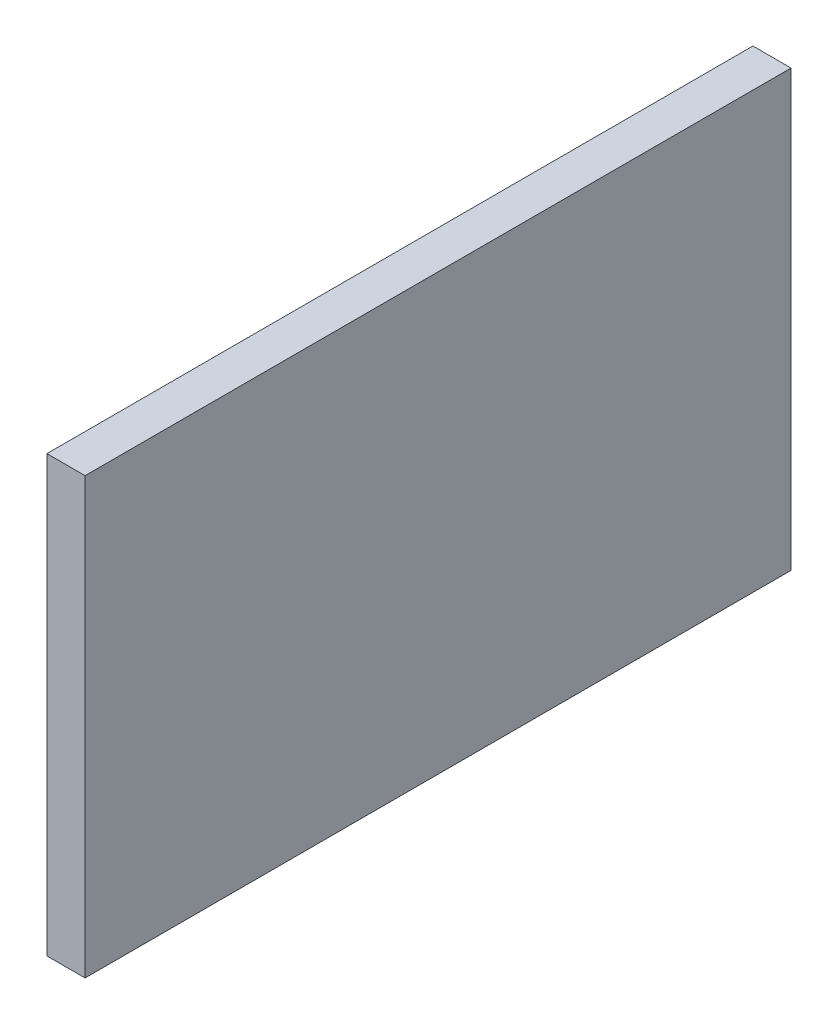
ISO-10303-21;
HEADER;
FILE_DESCRIPTION(('STEP AP214'),'2;1');
FILE_NAME('part.step','',(''),(''),'','','');
FILE_SCHEMA(('AUTOMOTIVE_DESIGN { 1 0 10303 214 1 1 1 1 }'));
ENDSEC;
DATA;
#1=APPLICATION_CONTEXT('core data for automotive mechanical design processes');
#2=APPLICATION_PROTOCOL_DEFINITION('international standard','automotive_design',2000,#1);
#3=PRODUCT_CONTEXT('',#1,'mechanical');
#4=PRODUCT('Part','Part','',(#3));
#5=PRODUCT_RELATED_PRODUCT_CATEGORY('part','',(#4));
#6=PRODUCT_DEFINITION_FORMATION('','',#4);
#7=PRODUCT_DEFINITION_CONTEXT('part definition',#1,'design');
#8=PRODUCT_DEFINITION('design','',#6,#7);
#9=PRODUCT_DEFINITION_SHAPE('','',#8);
#10=(LENGTH_UNIT() NAMED_UNIT(*) SI_UNIT(.MILLI.,.METRE.));
#11=(NAMED_UNIT(*) PLANE_ANGLE_UNIT() SI_UNIT($,.RADIAN.));
#12=(NAMED_UNIT(*) SI_UNIT($,.STERADIAN.) SOLID_ANGLE_UNIT());
#13=UNCERTAINTY_MEASURE_WITH_UNIT(LENGTH_MEASURE(1.E-05),#10,'distance_accuracy_value','');
#14=(GEOMETRIC_REPRESENTATION_CONTEXT(3) GLOBAL_UNCERTAINTY_ASSIGNED_CONTEXT((#13)) GLOBAL_UNIT_ASSIGNED_CONTEXT((#10,
#11,#12)) REPRESENTATION_CONTEXT('',''));
#15=CARTESIAN_POINT('',(0.,0.,0.));
#16=DIRECTION('',(0.,0.,1.));
#17=DIRECTION('',(1.,0.,0.));
#18=AXIS2_PLACEMENT_3D('',#15,#16,#17);
#19=CARTESIAN_POINT('',(10.,57.,-92.5));
#20=DIRECTION('',(0.,0.,1.));
#21=DIRECTION('',(0.,-1.,0.));
#22=AXIS2_PLACEMENT_3D('',#19,#20,#21);
#23=PLANE('',#22);
#24=DIRECTION('',(0.,1.,0.));
#25=VECTOR('',#24,1.);
#26=CARTESIAN_POINT('',(0.,57.,-92.5));
#27=LINE('',#26,#25);
#28=CARTESIAN_POINT('',(0.,-57.,-92.5));
#29=VERTEX_POINT('',#28);
#30=CARTESIAN_POINT('',(0.,57.,-92.5));
#31=VERTEX_POINT('',#30);
#32=EDGE_CURVE('E100',#29,#31,#27,.T.);
#33=ORIENTED_EDGE('',*,*,#32,.T.);
#34=DIRECTION('',(-1.,0.,0.));
#35=VECTOR('',#34,1.);
#36=CARTESIAN_POINT('',(10.,57.,-92.5));
#37=LINE('',#36,#35);
#38=CARTESIAN_POINT('',(10.,57.,-92.5));
#39=VERTEX_POINT('',#38);
#40=EDGE_CURVE('E11',#39,#31,#37,.T.);
#41=ORIENTED_EDGE('',*,*,#40,.F.);
#42=DIRECTION('',(0.,1.,0.));
#43=VECTOR('',#42,1.);
#44=CARTESIAN_POINT('',(10.,57.,-92.5));
#45=LINE('',#44,#43);
#46=CARTESIAN_POINT('',(10.,-57.,-92.5));
#47=VERTEX_POINT('',#46);
#48=EDGE_CURVE('E88',#47,#39,#45,.T.);
#49=ORIENTED_EDGE('',*,*,#48,.F.);
#50=DIRECTION('',(-1.,0.,0.));
#51=VECTOR('',#50,1.);
#52=CARTESIAN_POINT('',(10.,-57.,-92.5));
#53=LINE('',#52,#51);
#54=EDGE_CURVE('E96',#47,#29,#53,.T.);
#55=ORIENTED_EDGE('',*,*,#54,.T.);
#56=EDGE_LOOP('',(#33,#41,#49,#55));
#57=FACE_BOUND('',#56,.T.);
#58=ADVANCED_FACE('F37',(#57),#23,.F.);
#59=CARTESIAN_POINT('',(10.,57.,92.5));
#60=DIRECTION('',(0.,-1.,0.));
#61=DIRECTION('',(0.,0.,-1.));
#62=AXIS2_PLACEMENT_3D('',#59,#60,#61);
#63=PLANE('',#62);
#64=DIRECTION('',(0.,0.,1.));
#65=VECTOR('',#64,1.);
#66=CARTESIAN_POINT('',(0.,57.,92.5));
#67=LINE('',#66,#65);
#68=CARTESIAN_POINT('',(0.,57.,92.5));
#69=VERTEX_POINT('',#68);
#70=EDGE_CURVE('E92',#31,#69,#67,.T.);
#71=ORIENTED_EDGE('',*,*,#70,.T.);
#72=DIRECTION('',(-1.,0.,0.));
#73=VECTOR('',#72,1.);
#74=CARTESIAN_POINT('',(10.,57.,92.5));
#75=LINE('',#74,#73);
#76=CARTESIAN_POINT('',(10.,57.,92.5));
#77=VERTEX_POINT('',#76);
#78=EDGE_CURVE('E45',#77,#69,#75,.T.);
#79=ORIENTED_EDGE('',*,*,#78,.F.);
#80=DIRECTION('',(0.,0.,1.));
#81=VECTOR('',#80,1.);
#82=CARTESIAN_POINT('',(10.,57.,92.5));
#83=LINE('',#82,#81);
#84=EDGE_CURVE('E83',#39,#77,#83,.T.);
#85=ORIENTED_EDGE('',*,*,#84,.F.);
#86=ORIENTED_EDGE('',*,*,#40,.T.);
#87=EDGE_LOOP('',(#71,#79,#85,#86));
#88=FACE_BOUND('',#87,.T.);
#89=ADVANCED_FACE('F91',(#88),#63,.F.);
#90=CARTESIAN_POINT('',(10.,57.,92.5));
#91=DIRECTION('',(0.,0.,-1.));
#92=DIRECTION('',(0.,1.,0.));
#93=AXIS2_PLACEMENT_3D('',#90,#91,#92);
#94=PLANE('',#93);
#95=DIRECTION('',(0.,-1.,0.));
#96=VECTOR('',#95,1.);
#97=CARTESIAN_POINT('',(0.,57.,92.5));
#98=LINE('',#97,#96);
#99=CARTESIAN_POINT('',(0.,-57.,92.5));
#100=VERTEX_POINT('',#99);
#101=EDGE_CURVE('E70',#69,#100,#98,.T.);
#102=ORIENTED_EDGE('',*,*,#101,.T.);
#103=DIRECTION('',(-1.,0.,0.));
#104=VECTOR('',#103,1.);
#105=CARTESIAN_POINT('',(10.,-57.,92.5));
#106=LINE('',#105,#104);
#107=CARTESIAN_POINT('',(10.,-57.,92.5));
#108=VERTEX_POINT('',#107);
#109=EDGE_CURVE('E93',#108,#100,#106,.T.);
#110=ORIENTED_EDGE('',*,*,#109,.F.);
#111=DIRECTION('',(0.,-1.,0.));
#112=VECTOR('',#111,1.);
#113=CARTESIAN_POINT('',(10.,57.,92.5));
#114=LINE('',#113,#112);
#115=EDGE_CURVE('E86',#77,#108,#114,.T.);
#116=ORIENTED_EDGE('',*,*,#115,.F.);
#117=ORIENTED_EDGE('',*,*,#78,.T.);
#118=EDGE_LOOP('',(#102,#110,#116,#117));
#119=FACE_BOUND('',#118,.T.);
#120=ADVANCED_FACE('F94',(#119),#94,.F.);
#121=CARTESIAN_POINT('',(10.,-57.,92.5));
#122=DIRECTION('',(0.,1.,0.));
#123=DIRECTION('',(0.,0.,1.));
#124=AXIS2_PLACEMENT_3D('',#121,#122,#123);
#125=PLANE('',#124);
#126=DIRECTION('',(0.,0.,-1.));
#127=VECTOR('',#126,1.);
#128=CARTESIAN_POINT('',(0.,-57.,92.5));
#129=LINE('',#128,#127);
#130=EDGE_CURVE('E76',#100,#29,#129,.T.);
#131=ORIENTED_EDGE('',*,*,#130,.T.);
#132=ORIENTED_EDGE('',*,*,#54,.F.);
#133=DIRECTION('',(0.,0.,-1.));
#134=VECTOR('',#133,1.);
#135=CARTESIAN_POINT('',(10.,-57.,92.5));
#136=LINE('',#135,#134);
#137=EDGE_CURVE('E53',#108,#47,#136,.T.);
#138=ORIENTED_EDGE('',*,*,#137,.F.);
#139=ORIENTED_EDGE('',*,*,#109,.T.);
#140=EDGE_LOOP('',(#131,#132,#138,#139));
#141=FACE_BOUND('',#140,.T.);
#142=ADVANCED_FACE('F107',(#141),#125,.F.);
#143=CARTESIAN_POINT('',(10.,0.,0.));
#144=DIRECTION('',(1.,0.,0.));
#145=DIRECTION('',(0.,0.,-1.));
#146=AXIS2_PLACEMENT_3D('',#143,#144,#145);
#147=PLANE('',#146);
#148=ORIENTED_EDGE('',*,*,#48,.T.);
#149=ORIENTED_EDGE('',*,*,#84,.T.);
#150=ORIENTED_EDGE('',*,*,#115,.T.);
#151=ORIENTED_EDGE('',*,*,#137,.T.);
#152=EDGE_LOOP('',(#148,#149,#150,#151));
#153=FACE_BOUND('',#152,.T.);
#154=ADVANCED_FACE('F84',(#153),#147,.T.);
#155=CARTESIAN_POINT('',(0.,0.,0.));
#156=DIRECTION('',(1.,0.,0.));
#157=DIRECTION('',(0.,0.,-1.));
#158=AXIS2_PLACEMENT_3D('',#155,#156,#157);
#159=PLANE('',#158);
#160=ORIENTED_EDGE('',*,*,#32,.F.);
#161=ORIENTED_EDGE('',*,*,#130,.F.);
#162=ORIENTED_EDGE('',*,*,#101,.F.);
#163=ORIENTED_EDGE('',*,*,#70,.F.);
#164=EDGE_LOOP('',(#160,#161,#162,#163));
#165=FACE_BOUND('',#164,.T.);
#166=ADVANCED_FACE('F110',(#165),#159,.F.);
#167=CLOSED_SHELL('',(#58,#89,#120,#142,#154,#166));
#168=MANIFOLD_SOLID_BREP('B2',#167);
#169=ADVANCED_BREP_SHAPE_REPRESENTATION('',(#18,#168),#14);
#170=SHAPE_DEFINITION_REPRESENTATION(#9,#169);
ENDSEC;
END-ISO-10303-21;
